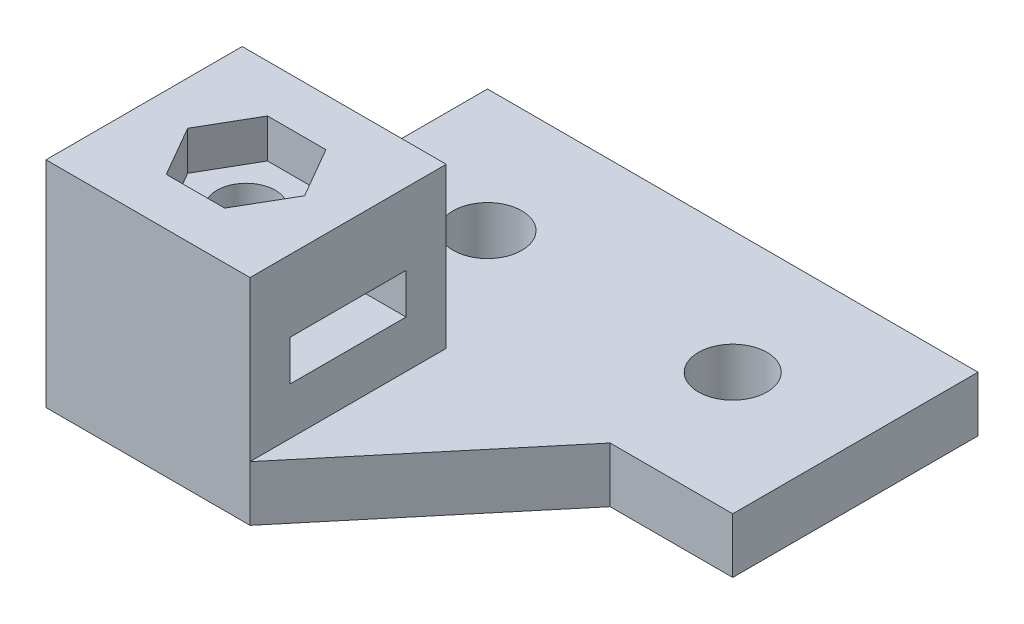
ISO-10303-21;
HEADER;
FILE_DESCRIPTION(('STEP AP214'),'2;1');
FILE_NAME('part.step','',(''),(''),'','','');
FILE_SCHEMA(('AUTOMOTIVE_DESIGN { 1 0 10303 214 1 1 1 1 }'));
ENDSEC;
DATA;
#1=APPLICATION_CONTEXT('core data for automotive mechanical design processes');
#2=APPLICATION_PROTOCOL_DEFINITION('international standard','automotive_design',2000,#1);
#3=PRODUCT_CONTEXT('',#1,'mechanical');
#4=PRODUCT('Part','Part','',(#3));
#5=PRODUCT_RELATED_PRODUCT_CATEGORY('part','',(#4));
#6=PRODUCT_DEFINITION_FORMATION('','',#4);
#7=PRODUCT_DEFINITION_CONTEXT('part definition',#1,'design');
#8=PRODUCT_DEFINITION('design','',#6,#7);
#9=PRODUCT_DEFINITION_SHAPE('','',#8);
#10=(LENGTH_UNIT() NAMED_UNIT(*) SI_UNIT(.MILLI.,.METRE.));
#11=(NAMED_UNIT(*) PLANE_ANGLE_UNIT() SI_UNIT($,.RADIAN.));
#12=(NAMED_UNIT(*) SI_UNIT($,.STERADIAN.) SOLID_ANGLE_UNIT());
#13=UNCERTAINTY_MEASURE_WITH_UNIT(LENGTH_MEASURE(1.E-05),#10,'distance_accuracy_value','');
#14=(GEOMETRIC_REPRESENTATION_CONTEXT(3) GLOBAL_UNCERTAINTY_ASSIGNED_CONTEXT((#13)) GLOBAL_UNIT_ASSIGNED_CONTEXT((#10,
#11,#12)) REPRESENTATION_CONTEXT('',''));
#15=CARTESIAN_POINT('',(0.,0.,0.));
#16=DIRECTION('',(0.,0.,1.));
#17=DIRECTION('',(1.,0.,0.));
#18=AXIS2_PLACEMENT_3D('',#15,#16,#17);
#19=CARTESIAN_POINT('',(-10.,4.5,0.));
#20=DIRECTION('',(-1.,0.,0.));
#21=DIRECTION('',(0.,0.,1.));
#22=AXIS2_PLACEMENT_3D('',#19,#20,#21);
#23=PLANE('',#22);
#24=DIRECTION('',(0.,0.,-1.));
#25=VECTOR('',#24,1.);
#26=CARTESIAN_POINT('',(-10.,0.,0.));
#27=LINE('',#26,#25);
#28=CARTESIAN_POINT('',(-10.,0.,26.));
#29=VERTEX_POINT('',#28);
#30=CARTESIAN_POINT('',(-10.,0.,-10.));
#31=VERTEX_POINT('',#30);
#32=EDGE_CURVE('E317',#29,#31,#27,.T.);
#33=ORIENTED_EDGE('',*,*,#32,.F.);
#34=DIRECTION('',(0.,-1.,0.));
#35=VECTOR('',#34,1.);
#36=CARTESIAN_POINT('',(-10.,17.5,26.));
#37=LINE('',#36,#35);
#38=CARTESIAN_POINT('',(-10.,17.5,26.));
#39=VERTEX_POINT('',#38);
#40=EDGE_CURVE('E267',#39,#29,#37,.T.);
#41=ORIENTED_EDGE('',*,*,#40,.F.);
#42=DIRECTION('',(0.,0.,-1.));
#43=VECTOR('',#42,1.);
#44=CARTESIAN_POINT('',(-10.,17.5,0.));
#45=LINE('',#44,#43);
#46=CARTESIAN_POINT('',(-10.,17.5,10.));
#47=VERTEX_POINT('',#46);
#48=EDGE_CURVE('E256',#39,#47,#45,.T.);
#49=ORIENTED_EDGE('',*,*,#48,.T.);
#50=DIRECTION('',(0.,-1.,0.));
#51=VECTOR('',#50,1.);
#52=CARTESIAN_POINT('',(-10.,17.5,10.));
#53=LINE('',#52,#51);
#54=CARTESIAN_POINT('',(-10.,4.5,10.));
#55=VERTEX_POINT('',#54);
#56=EDGE_CURVE('E270',#47,#55,#53,.T.);
#57=ORIENTED_EDGE('',*,*,#56,.T.);
#58=DIRECTION('',(0.,0.,-1.));
#59=VECTOR('',#58,1.);
#60=CARTESIAN_POINT('',(-10.,4.5,0.));
#61=LINE('',#60,#59);
#62=CARTESIAN_POINT('',(-10.,4.5,-10.));
#63=VERTEX_POINT('',#62);
#64=EDGE_CURVE('E294',#55,#63,#61,.T.);
#65=ORIENTED_EDGE('',*,*,#64,.T.);
#66=DIRECTION('',(0.,-1.,0.));
#67=VECTOR('',#66,1.);
#68=CARTESIAN_POINT('',(-10.,4.5,-10.));
#69=LINE('',#68,#67);
#70=EDGE_CURVE('E326',#63,#31,#69,.T.);
#71=ORIENTED_EDGE('',*,*,#70,.T.);
#72=EDGE_LOOP('',(#33,#41,#49,#57,#65,#71));
#73=FACE_BOUND('',#72,.T.);
#74=DIRECTION('',(0.,0.,-1.));
#75=VECTOR('',#74,1.);
#76=CARTESIAN_POINT('',(-10.,11.65,22.725));
#77=LINE('',#76,#75);
#78=CARTESIAN_POINT('',(-10.,11.65,22.725));
#79=VERTEX_POINT('',#78);
#80=CARTESIAN_POINT('',(-10.,11.65,13.275));
#81=VERTEX_POINT('',#80);
#82=EDGE_CURVE('E223',#79,#81,#77,.T.);
#83=ORIENTED_EDGE('',*,*,#82,.F.);
#84=DIRECTION('',(0.,1.,0.));
#85=VECTOR('',#84,1.);
#86=CARTESIAN_POINT('',(-10.,8.35,22.725));
#87=LINE('',#86,#85);
#88=CARTESIAN_POINT('',(-10.,8.35,22.725));
#89=VERTEX_POINT('',#88);
#90=EDGE_CURVE('E221',#89,#79,#87,.T.);
#91=ORIENTED_EDGE('',*,*,#90,.F.);
#92=DIRECTION('',(0.,0.,-1.));
#93=VECTOR('',#92,1.);
#94=CARTESIAN_POINT('',(-10.,8.35,22.725));
#95=LINE('',#94,#93);
#96=CARTESIAN_POINT('',(-10.,8.35,13.275));
#97=VERTEX_POINT('',#96);
#98=EDGE_CURVE('E227',#89,#97,#95,.T.);
#99=ORIENTED_EDGE('',*,*,#98,.T.);
#100=DIRECTION('',(0.,1.,0.));
#101=VECTOR('',#100,1.);
#102=CARTESIAN_POINT('',(-10.,8.35,13.275));
#103=LINE('',#102,#101);
#104=EDGE_CURVE('E58',#97,#81,#103,.T.);
#105=ORIENTED_EDGE('',*,*,#104,.T.);
#106=EDGE_LOOP('',(#83,#91,#99,#105));
#107=FACE_BOUND('',#106,.T.);
#108=ADVANCED_FACE('F35',(#73,#107),#23,.T.);
#109=CARTESIAN_POINT('',(6.63635443655153,17.5,0.));
#110=DIRECTION('',(1.,0.,0.));
#111=DIRECTION('',(0.,0.,-1.));
#112=AXIS2_PLACEMENT_3D('',#109,#110,#111);
#113=PLANE('',#112);
#114=DIRECTION('',(0.,-1.,0.));
#115=VECTOR('',#114,1.);
#116=CARTESIAN_POINT('',(6.63635443655153,17.5,26.));
#117=LINE('',#116,#115);
#118=CARTESIAN_POINT('',(6.63635443655153,17.5,26.));
#119=VERTEX_POINT('',#118);
#120=CARTESIAN_POINT('',(6.63635443655153,4.5,26.));
#121=VERTEX_POINT('',#120);
#122=EDGE_CURVE('E262',#119,#121,#117,.T.);
#123=ORIENTED_EDGE('',*,*,#122,.T.);
#124=DIRECTION('',(0.,0.,1.));
#125=VECTOR('',#124,1.);
#126=CARTESIAN_POINT('',(6.63635443655153,4.5,0.));
#127=LINE('',#126,#125);
#128=CARTESIAN_POINT('',(6.63635443655153,4.5,10.));
#129=VERTEX_POINT('',#128);
#130=EDGE_CURVE('E297',#129,#121,#127,.T.);
#131=ORIENTED_EDGE('',*,*,#130,.F.);
#132=DIRECTION('',(0.,-1.,0.));
#133=VECTOR('',#132,1.);
#134=CARTESIAN_POINT('',(6.63635443655153,17.5,10.));
#135=LINE('',#134,#133);
#136=CARTESIAN_POINT('',(6.63635443655153,17.5,10.));
#137=VERTEX_POINT('',#136);
#138=EDGE_CURVE('E273',#137,#129,#135,.T.);
#139=ORIENTED_EDGE('',*,*,#138,.F.);
#140=DIRECTION('',(0.,0.,1.));
#141=VECTOR('',#140,1.);
#142=CARTESIAN_POINT('',(6.63635443655153,17.5,0.));
#143=LINE('',#142,#141);
#144=EDGE_CURVE('E251',#137,#119,#143,.T.);
#145=ORIENTED_EDGE('',*,*,#144,.T.);
#146=EDGE_LOOP('',(#123,#131,#139,#145));
#147=FACE_BOUND('',#146,.T.);
#148=DIRECTION('',(0.,0.,-1.));
#149=VECTOR('',#148,1.);
#150=CARTESIAN_POINT('',(6.63635443655153,8.35,22.725));
#151=LINE('',#150,#149);
#152=CARTESIAN_POINT('',(6.63635443655153,8.35,22.725));
#153=VERTEX_POINT('',#152);
#154=CARTESIAN_POINT('',(6.63635443655153,8.35,13.275));
#155=VERTEX_POINT('',#154);
#156=EDGE_CURVE('E224',#153,#155,#151,.T.);
#157=ORIENTED_EDGE('',*,*,#156,.F.);
#158=DIRECTION('',(0.,1.,0.));
#159=VECTOR('',#158,1.);
#160=CARTESIAN_POINT('',(6.63635443655153,8.35,22.725));
#161=LINE('',#160,#159);
#162=CARTESIAN_POINT('',(6.63635443655153,11.65,22.725));
#163=VERTEX_POINT('',#162);
#164=EDGE_CURVE('E213',#153,#163,#161,.T.);
#165=ORIENTED_EDGE('',*,*,#164,.T.);
#166=DIRECTION('',(0.,0.,-1.));
#167=VECTOR('',#166,1.);
#168=CARTESIAN_POINT('',(6.63635443655153,11.65,22.725));
#169=LINE('',#168,#167);
#170=CARTESIAN_POINT('',(6.63635443655153,11.65,13.275));
#171=VERTEX_POINT('',#170);
#172=EDGE_CURVE('E233',#163,#171,#169,.T.);
#173=ORIENTED_EDGE('',*,*,#172,.T.);
#174=DIRECTION('',(0.,1.,0.));
#175=VECTOR('',#174,1.);
#176=CARTESIAN_POINT('',(6.63635443655153,8.35,13.275));
#177=LINE('',#176,#175);
#178=EDGE_CURVE('E236',#155,#171,#177,.T.);
#179=ORIENTED_EDGE('',*,*,#178,.F.);
#180=EDGE_LOOP('',(#157,#165,#173,#179));
#181=FACE_BOUND('',#180,.T.);
#182=ADVANCED_FACE('F364',(#147,#181),#113,.T.);
#183=CARTESIAN_POINT('',(0.,4.5,10.));
#184=DIRECTION('',(0.,0.,1.));
#185=DIRECTION('',(1.,0.,0.));
#186=AXIS2_PLACEMENT_3D('',#183,#184,#185);
#187=PLANE('',#186);
#188=DIRECTION('',(-1.,0.,0.));
#189=VECTOR('',#188,1.);
#190=CARTESIAN_POINT('',(0.,0.,10.));
#191=LINE('',#190,#189);
#192=CARTESIAN_POINT('',(30.,0.,10.));
#193=VERTEX_POINT('',#192);
#194=CARTESIAN_POINT('',(20.,0.,10.));
#195=VERTEX_POINT('',#194);
#196=EDGE_CURVE('E308',#193,#195,#191,.T.);
#197=ORIENTED_EDGE('',*,*,#196,.F.);
#198=DIRECTION('',(0.,-1.,0.));
#199=VECTOR('',#198,1.);
#200=CARTESIAN_POINT('',(30.,4.5,10.));
#201=LINE('',#200,#199);
#202=CARTESIAN_POINT('',(30.,4.5,10.));
#203=VERTEX_POINT('',#202);
#204=EDGE_CURVE('E11',#203,#193,#201,.T.);
#205=ORIENTED_EDGE('',*,*,#204,.F.);
#206=DIRECTION('',(-1.,0.,0.));
#207=VECTOR('',#206,1.);
#208=CARTESIAN_POINT('',(0.,4.5,10.));
#209=LINE('',#208,#207);
#210=CARTESIAN_POINT('',(20.,4.5,10.));
#211=VERTEX_POINT('',#210);
#212=EDGE_CURVE('E284',#203,#211,#209,.T.);
#213=ORIENTED_EDGE('',*,*,#212,.T.);
#214=DIRECTION('',(0.,-1.,0.));
#215=VECTOR('',#214,1.);
#216=CARTESIAN_POINT('',(20.,4.5,10.));
#217=LINE('',#216,#215);
#218=EDGE_CURVE('E302',#211,#195,#217,.T.);
#219=ORIENTED_EDGE('',*,*,#218,.T.);
#220=EDGE_LOOP('',(#197,#205,#213,#219));
#221=FACE_BOUND('',#220,.T.);
#222=ADVANCED_FACE('F360',(#221),#187,.T.);
#223=CARTESIAN_POINT('',(30.,4.5,0.));
#224=DIRECTION('',(1.,0.,0.));
#225=DIRECTION('',(0.,0.,-1.));
#226=AXIS2_PLACEMENT_3D('',#223,#224,#225);
#227=PLANE('',#226);
#228=DIRECTION('',(0.,0.,1.));
#229=VECTOR('',#228,1.);
#230=CARTESIAN_POINT('',(30.,0.,0.));
#231=LINE('',#230,#229);
#232=CARTESIAN_POINT('',(30.,0.,-10.));
#233=VERTEX_POINT('',#232);
#234=EDGE_CURVE('E311',#233,#193,#231,.T.);
#235=ORIENTED_EDGE('',*,*,#234,.F.);
#236=DIRECTION('',(0.,-1.,0.));
#237=VECTOR('',#236,1.);
#238=CARTESIAN_POINT('',(30.,4.5,-10.));
#239=LINE('',#238,#237);
#240=CARTESIAN_POINT('',(30.,4.5,-10.));
#241=VERTEX_POINT('',#240);
#242=EDGE_CURVE('E43',#241,#233,#239,.T.);
#243=ORIENTED_EDGE('',*,*,#242,.F.);
#244=DIRECTION('',(0.,0.,1.));
#245=VECTOR('',#244,1.);
#246=CARTESIAN_POINT('',(30.,4.5,0.));
#247=LINE('',#246,#245);
#248=EDGE_CURVE('E287',#241,#203,#247,.T.);
#249=ORIENTED_EDGE('',*,*,#248,.T.);
#250=ORIENTED_EDGE('',*,*,#204,.T.);
#251=EDGE_LOOP('',(#235,#243,#249,#250));
#252=FACE_BOUND('',#251,.T.);
#253=ADVANCED_FACE('F334',(#252),#227,.T.);
#254=CARTESIAN_POINT('',(0.,4.5,-10.));
#255=DIRECTION('',(0.,0.,-1.));
#256=DIRECTION('',(-1.,0.,0.));
#257=AXIS2_PLACEMENT_3D('',#254,#255,#256);
#258=PLANE('',#257);
#259=DIRECTION('',(1.,0.,0.));
#260=VECTOR('',#259,1.);
#261=CARTESIAN_POINT('',(0.,0.,-10.));
#262=LINE('',#261,#260);
#263=EDGE_CURVE('E314',#31,#233,#262,.T.);
#264=ORIENTED_EDGE('',*,*,#263,.F.);
#265=ORIENTED_EDGE('',*,*,#70,.F.);
#266=DIRECTION('',(1.,0.,0.));
#267=VECTOR('',#266,1.);
#268=CARTESIAN_POINT('',(0.,4.5,-10.));
#269=LINE('',#268,#267);
#270=EDGE_CURVE('E291',#63,#241,#269,.T.);
#271=ORIENTED_EDGE('',*,*,#270,.T.);
#272=ORIENTED_EDGE('',*,*,#242,.T.);
#273=EDGE_LOOP('',(#264,#265,#271,#272));
#274=FACE_BOUND('',#273,.T.);
#275=ADVANCED_FACE('F330',(#274),#258,.T.);
#276=CARTESIAN_POINT('',(0.,4.5,0.));
#277=DIRECTION('',(0.,-1.,0.));
#278=DIRECTION('',(0.,0.,-1.));
#279=AXIS2_PLACEMENT_3D('',#276,#277,#278);
#280=CYLINDRICAL_SURFACE('',#279,2.8);
#281=CARTESIAN_POINT('',(0.,4.5,0.));
#282=DIRECTION('',(0.,1.,0.));
#283=DIRECTION('',(0.,0.,1.));
#284=AXIS2_PLACEMENT_3D('',#281,#282,#283);
#285=CIRCLE('',#284,2.8);
#286=CARTESIAN_POINT('',(0.,4.5,2.8));
#287=VERTEX_POINT('',#286);
#288=EDGE_CURVE('E280',#287,#287,#285,.T.);
#289=ORIENTED_EDGE('',*,*,#288,.T.);
#290=EDGE_LOOP('',(#289));
#291=FACE_BOUND('',#290,.T.);
#292=CARTESIAN_POINT('',(0.,0.,0.));
#293=DIRECTION('',(0.,1.,0.));
#294=DIRECTION('',(0.,0.,1.));
#295=AXIS2_PLACEMENT_3D('',#292,#293,#294);
#296=CIRCLE('',#295,2.8);
#297=CARTESIAN_POINT('',(0.,0.,2.8));
#298=VERTEX_POINT('',#297);
#299=EDGE_CURVE('E305',#298,#298,#296,.T.);
#300=ORIENTED_EDGE('',*,*,#299,.F.);
#301=EDGE_LOOP('',(#300));
#302=FACE_BOUND('',#301,.T.);
#303=ADVANCED_FACE('F386',(#291,#302),#280,.F.);
#304=CARTESIAN_POINT('',(20.,4.5,0.));
#305=DIRECTION('',(0.,-1.,0.));
#306=DIRECTION('',(0.,0.,-1.));
#307=AXIS2_PLACEMENT_3D('',#304,#305,#306);
#308=CYLINDRICAL_SURFACE('',#307,2.8);
#309=CARTESIAN_POINT('',(20.,4.5,0.));
#310=DIRECTION('',(0.,1.,0.));
#311=DIRECTION('',(0.,0.,1.));
#312=AXIS2_PLACEMENT_3D('',#309,#310,#311);
#313=CIRCLE('',#312,2.8);
#314=CARTESIAN_POINT('',(20.,4.5,2.8));
#315=VERTEX_POINT('',#314);
#316=EDGE_CURVE('E277',#315,#315,#313,.T.);
#317=ORIENTED_EDGE('',*,*,#316,.T.);
#318=EDGE_LOOP('',(#317));
#319=FACE_BOUND('',#318,.T.);
#320=CARTESIAN_POINT('',(20.,0.,0.));
#321=DIRECTION('',(0.,1.,0.));
#322=DIRECTION('',(0.,0.,1.));
#323=AXIS2_PLACEMENT_3D('',#320,#321,#322);
#324=CIRCLE('',#323,2.8);
#325=CARTESIAN_POINT('',(20.,0.,2.8));
#326=VERTEX_POINT('',#325);
#327=EDGE_CURVE('E276',#326,#326,#324,.T.);
#328=ORIENTED_EDGE('',*,*,#327,.F.);
#329=EDGE_LOOP('',(#328));
#330=FACE_BOUND('',#329,.T.);
#331=ADVANCED_FACE('F37',(#319,#330),#308,.F.);
#332=CARTESIAN_POINT('',(16.7013346240728,4.5,13.9494197720412));
#333=DIRECTION('',(-0.767505693478615,0.,-0.641042128473559));
#334=DIRECTION('',(-0.641042128473559,0.,0.767505693478615));
#335=AXIS2_PLACEMENT_3D('',#332,#333,#334);
#336=PLANE('',#335);
#337=DIRECTION('',(0.641042128473559,0.,-0.767505693478615));
#338=VECTOR('',#337,1.);
#339=CARTESIAN_POINT('',(16.7013346240728,0.,13.9494197720412));
#340=LINE('',#339,#338);
#341=CARTESIAN_POINT('',(6.63635443655153,0.,26.));
#342=VERTEX_POINT('',#341);
#343=EDGE_CURVE('E281',#342,#195,#340,.T.);
#344=ORIENTED_EDGE('',*,*,#343,.T.);
#345=ORIENTED_EDGE('',*,*,#218,.F.);
#346=DIRECTION('',(0.641042128473559,0.,-0.767505693478615));
#347=VECTOR('',#346,1.);
#348=CARTESIAN_POINT('',(16.7013346240728,4.5,13.9494197720412));
#349=LINE('',#348,#347);
#350=EDGE_CURVE('E300',#121,#211,#349,.T.);
#351=ORIENTED_EDGE('',*,*,#350,.F.);
#352=DIRECTION('',(0.,-1.,0.));
#353=VECTOR('',#352,1.);
#354=CARTESIAN_POINT('',(6.63635443655153,4.5,26.));
#355=LINE('',#354,#353);
#356=EDGE_CURVE('E323',#121,#342,#355,.T.);
#357=ORIENTED_EDGE('',*,*,#356,.T.);
#358=EDGE_LOOP('',(#344,#345,#351,#357));
#359=FACE_BOUND('',#358,.T.);
#360=ADVANCED_FACE('F362',(#359),#336,.F.);
#361=CARTESIAN_POINT('',(0.,4.5,0.));
#362=DIRECTION('',(0.,1.,0.));
#363=DIRECTION('',(0.,0.,1.));
#364=AXIS2_PLACEMENT_3D('',#361,#362,#363);
#365=PLANE('',#364);
#366=ORIENTED_EDGE('',*,*,#316,.F.);
#367=EDGE_LOOP('',(#366));
#368=FACE_BOUND('',#367,.T.);
#369=ORIENTED_EDGE('',*,*,#288,.F.);
#370=EDGE_LOOP('',(#369));
#371=FACE_BOUND('',#370,.T.);
#372=ORIENTED_EDGE('',*,*,#212,.F.);
#373=ORIENTED_EDGE('',*,*,#248,.F.);
#374=ORIENTED_EDGE('',*,*,#270,.F.);
#375=ORIENTED_EDGE('',*,*,#64,.F.);
#376=EDGE_CURVE('E288',#129,#55,#209,.T.);
#377=ORIENTED_EDGE('',*,*,#376,.F.);
#378=ORIENTED_EDGE('',*,*,#130,.T.);
#379=ORIENTED_EDGE('',*,*,#350,.T.);
#380=EDGE_LOOP('',(#372,#373,#374,#375,#377,#378,#379));
#381=FACE_BOUND('',#380,.T.);
#382=ADVANCED_FACE('F356',(#368,#371,#381),#365,.T.);
#383=CARTESIAN_POINT('',(0.,0.,0.));
#384=DIRECTION('',(0.,1.,0.));
#385=DIRECTION('',(0.,0.,1.));
#386=AXIS2_PLACEMENT_3D('',#383,#384,#385);
#387=PLANE('',#386);
#388=ORIENTED_EDGE('',*,*,#343,.F.);
#389=DIRECTION('',(-1.,0.,0.));
#390=VECTOR('',#389,1.);
#391=CARTESIAN_POINT('',(0.,0.,26.));
#392=LINE('',#391,#390);
#393=EDGE_CURVE('E250',#342,#29,#392,.T.);
#394=ORIENTED_EDGE('',*,*,#393,.T.);
#395=ORIENTED_EDGE('',*,*,#32,.T.);
#396=ORIENTED_EDGE('',*,*,#263,.T.);
#397=ORIENTED_EDGE('',*,*,#234,.T.);
#398=ORIENTED_EDGE('',*,*,#196,.T.);
#399=EDGE_LOOP('',(#388,#394,#395,#396,#397,#398));
#400=FACE_BOUND('',#399,.T.);
#401=ORIENTED_EDGE('',*,*,#327,.T.);
#402=EDGE_LOOP('',(#401));
#403=FACE_BOUND('',#402,.T.);
#404=ORIENTED_EDGE('',*,*,#299,.T.);
#405=EDGE_LOOP('',(#404));
#406=FACE_BOUND('',#405,.T.);
#407=ADVANCED_FACE('F338',(#400,#403,#406),#387,.F.);
#408=CARTESIAN_POINT('',(0.,17.5,10.));
#409=DIRECTION('',(0.,0.,1.));
#410=DIRECTION('',(1.,0.,0.));
#411=AXIS2_PLACEMENT_3D('',#408,#409,#410);
#412=PLANE('',#411);
#413=ORIENTED_EDGE('',*,*,#376,.T.);
#414=ORIENTED_EDGE('',*,*,#56,.F.);
#415=DIRECTION('',(-1.,0.,0.));
#416=VECTOR('',#415,1.);
#417=CARTESIAN_POINT('',(0.,17.5,10.));
#418=LINE('',#417,#416);
#419=EDGE_CURVE('E254',#137,#47,#418,.T.);
#420=ORIENTED_EDGE('',*,*,#419,.F.);
#421=ORIENTED_EDGE('',*,*,#138,.T.);
#422=EDGE_LOOP('',(#413,#414,#420,#421));
#423=FACE_BOUND('',#422,.T.);
#424=ADVANCED_FACE('F366',(#423),#412,.F.);
#425=CARTESIAN_POINT('',(0.,17.5,26.));
#426=DIRECTION('',(0.,0.,1.));
#427=DIRECTION('',(1.,0.,0.));
#428=AXIS2_PLACEMENT_3D('',#425,#426,#427);
#429=PLANE('',#428);
#430=ORIENTED_EDGE('',*,*,#393,.F.);
#431=ORIENTED_EDGE('',*,*,#356,.F.);
#432=ORIENTED_EDGE('',*,*,#122,.F.);
#433=DIRECTION('',(-1.,0.,0.));
#434=VECTOR('',#433,1.);
#435=CARTESIAN_POINT('',(0.,17.5,26.));
#436=LINE('',#435,#434);
#437=EDGE_CURVE('E259',#119,#39,#436,.T.);
#438=ORIENTED_EDGE('',*,*,#437,.T.);
#439=ORIENTED_EDGE('',*,*,#40,.T.);
#440=EDGE_LOOP('',(#430,#431,#432,#438,#439));
#441=FACE_BOUND('',#440,.T.);
#442=ADVANCED_FACE('F344',(#441),#429,.T.);
#443=CARTESIAN_POINT('',(0.,17.5,0.));
#444=DIRECTION('',(0.,1.,0.));
#445=DIRECTION('',(0.,0.,1.));
#446=AXIS2_PLACEMENT_3D('',#443,#444,#445);
#447=PLANE('',#446);
#448=DIRECTION('',(0.5,0.,0.866025403784439));
#449=VECTOR('',#448,1.);
#450=CARTESIAN_POINT('',(-6.44784925388459,17.5,18.));
#451=LINE('',#450,#449);
#452=CARTESIAN_POINT('',(-6.44784925388459,17.5,18.));
#453=VERTEX_POINT('',#452);
#454=CARTESIAN_POINT('',(-4.06483601780441,17.5,22.1275));
#455=VERTEX_POINT('',#454);
#456=EDGE_CURVE('E50',#453,#455,#451,.T.);
#457=ORIENTED_EDGE('',*,*,#456,.F.);
#458=DIRECTION('',(-0.5,0.,0.866025403784439));
#459=VECTOR('',#458,1.);
#460=CARTESIAN_POINT('',(-4.06483601780442,17.5,13.8725));
#461=LINE('',#460,#459);
#462=CARTESIAN_POINT('',(-4.06483601780442,17.5,13.8725));
#463=VERTEX_POINT('',#462);
#464=EDGE_CURVE('E184',#463,#453,#461,.T.);
#465=ORIENTED_EDGE('',*,*,#464,.F.);
#466=DIRECTION('',(-1.,0.,0.));
#467=VECTOR('',#466,1.);
#468=CARTESIAN_POINT('',(0.701190454355942,17.5,13.8725));
#469=LINE('',#468,#467);
#470=CARTESIAN_POINT('',(0.701190454355942,17.5,13.8725));
#471=VERTEX_POINT('',#470);
#472=EDGE_CURVE('E187',#471,#463,#469,.T.);
#473=ORIENTED_EDGE('',*,*,#472,.F.);
#474=DIRECTION('',(-0.5,0.,-0.866025403784438));
#475=VECTOR('',#474,1.);
#476=CARTESIAN_POINT('',(3.08420369043612,17.5,18.));
#477=LINE('',#476,#475);
#478=CARTESIAN_POINT('',(3.08420369043612,17.5,18.));
#479=VERTEX_POINT('',#478);
#480=EDGE_CURVE('E206',#479,#471,#477,.T.);
#481=ORIENTED_EDGE('',*,*,#480,.F.);
#482=DIRECTION('',(0.5,0.,-0.866025403784439));
#483=VECTOR('',#482,1.);
#484=CARTESIAN_POINT('',(0.701190454355943,17.5,22.1275));
#485=LINE('',#484,#483);
#486=CARTESIAN_POINT('',(0.701190454355943,17.5,22.1275));
#487=VERTEX_POINT('',#486);
#488=EDGE_CURVE('E203',#487,#479,#485,.T.);
#489=ORIENTED_EDGE('',*,*,#488,.F.);
#490=DIRECTION('',(1.,0.,0.));
#491=VECTOR('',#490,1.);
#492=CARTESIAN_POINT('',(-4.06483601780441,17.5,22.1275));
#493=LINE('',#492,#491);
#494=EDGE_CURVE('E201',#455,#487,#493,.T.);
#495=ORIENTED_EDGE('',*,*,#494,.F.);
#496=EDGE_LOOP('',(#457,#465,#473,#481,#489,#495));
#497=FACE_BOUND('',#496,.T.);
#498=ORIENTED_EDGE('',*,*,#144,.F.);
#499=ORIENTED_EDGE('',*,*,#419,.T.);
#500=ORIENTED_EDGE('',*,*,#48,.F.);
#501=ORIENTED_EDGE('',*,*,#437,.F.);
#502=EDGE_LOOP('',(#498,#499,#500,#501));
#503=FACE_BOUND('',#502,.T.);
#504=ADVANCED_FACE('F348',(#497,#503),#447,.T.);
#505=CARTESIAN_POINT('',(-10.,8.35,22.725));
#506=DIRECTION('',(0.,0.,-1.));
#507=DIRECTION('',(-1.,0.,0.));
#508=AXIS2_PLACEMENT_3D('',#505,#506,#507);
#509=PLANE('',#508);
#510=ORIENTED_EDGE('',*,*,#164,.F.);
#511=DIRECTION('',(1.,0.,0.));
#512=VECTOR('',#511,1.);
#513=CARTESIAN_POINT('',(-10.,8.35,22.725));
#514=LINE('',#513,#512);
#515=EDGE_CURVE('E230',#89,#153,#514,.T.);
#516=ORIENTED_EDGE('',*,*,#515,.F.);
#517=ORIENTED_EDGE('',*,*,#90,.T.);
#518=DIRECTION('',(1.,0.,0.));
#519=VECTOR('',#518,1.);
#520=CARTESIAN_POINT('',(-10.,11.65,22.725));
#521=LINE('',#520,#519);
#522=EDGE_CURVE('E247',#79,#163,#521,.T.);
#523=ORIENTED_EDGE('',*,*,#522,.T.);
#524=EDGE_LOOP('',(#510,#516,#517,#523));
#525=FACE_BOUND('',#524,.T.);
#526=ADVANCED_FACE('F454',(#525),#509,.T.);
#527=CARTESIAN_POINT('',(-10.,11.65,22.725));
#528=DIRECTION('',(0.,-1.,0.));
#529=DIRECTION('',(0.,0.,-1.));
#530=AXIS2_PLACEMENT_3D('',#527,#528,#529);
#531=PLANE('',#530);
#532=CARTESIAN_POINT('',(-1.68182278172424,11.65,18.));
#533=DIRECTION('',(0.,-1.,0.));
#534=DIRECTION('',(0.,0.,-1.));
#535=AXIS2_PLACEMENT_3D('',#532,#533,#534);
#536=CIRCLE('',#535,2.38125);
#537=CARTESIAN_POINT('',(-1.68182278172424,11.65,15.61875));
#538=VERTEX_POINT('',#537);
#539=EDGE_CURVE('E580',#538,#538,#536,.F.);
#540=ORIENTED_EDGE('',*,*,#539,.T.);
#541=EDGE_LOOP('',(#540));
#542=FACE_BOUND('',#541,.T.);
#543=ORIENTED_EDGE('',*,*,#172,.F.);
#544=ORIENTED_EDGE('',*,*,#522,.F.);
#545=ORIENTED_EDGE('',*,*,#82,.T.);
#546=DIRECTION('',(1.,0.,0.));
#547=VECTOR('',#546,1.);
#548=CARTESIAN_POINT('',(-10.,11.65,13.275));
#549=LINE('',#548,#547);
#550=EDGE_CURVE('E245',#81,#171,#549,.T.);
#551=ORIENTED_EDGE('',*,*,#550,.T.);
#552=EDGE_LOOP('',(#543,#544,#545,#551));
#553=FACE_BOUND('',#552,.T.);
#554=ADVANCED_FACE('F459',(#542,#553),#531,.T.);
#555=CARTESIAN_POINT('',(-10.,8.35,13.275));
#556=DIRECTION('',(0.,0.,-1.));
#557=DIRECTION('',(-1.,0.,0.));
#558=AXIS2_PLACEMENT_3D('',#555,#556,#557);
#559=PLANE('',#558);
#560=ORIENTED_EDGE('',*,*,#178,.T.);
#561=ORIENTED_EDGE('',*,*,#550,.F.);
#562=ORIENTED_EDGE('',*,*,#104,.F.);
#563=DIRECTION('',(1.,0.,0.));
#564=VECTOR('',#563,1.);
#565=CARTESIAN_POINT('',(-10.,8.35,13.275));
#566=LINE('',#565,#564);
#567=EDGE_CURVE('E243',#97,#155,#566,.T.);
#568=ORIENTED_EDGE('',*,*,#567,.T.);
#569=EDGE_LOOP('',(#560,#561,#562,#568));
#570=FACE_BOUND('',#569,.T.);
#571=ADVANCED_FACE('F468',(#570),#559,.F.);
#572=CARTESIAN_POINT('',(-10.,8.35,22.725));
#573=DIRECTION('',(0.,-1.,0.));
#574=DIRECTION('',(0.,0.,-1.));
#575=AXIS2_PLACEMENT_3D('',#572,#573,#574);
#576=PLANE('',#575);
#577=ORIENTED_EDGE('',*,*,#156,.T.);
#578=ORIENTED_EDGE('',*,*,#567,.F.);
#579=ORIENTED_EDGE('',*,*,#98,.F.);
#580=ORIENTED_EDGE('',*,*,#515,.T.);
#581=EDGE_LOOP('',(#577,#578,#579,#580));
#582=FACE_BOUND('',#581,.T.);
#583=ADVANCED_FACE('F473',(#582),#576,.F.);
#584=CARTESIAN_POINT('',(-6.44784925388459,14.32,18.));
#585=DIRECTION('',(-0.866025403784439,0.,0.5));
#586=DIRECTION('',(0.5,0.,0.866025403784439));
#587=AXIS2_PLACEMENT_3D('',#584,#585,#586);
#588=PLANE('',#587);
#589=ORIENTED_EDGE('',*,*,#456,.T.);
#590=DIRECTION('',(0.,1.,0.));
#591=VECTOR('',#590,1.);
#592=CARTESIAN_POINT('',(-4.06483601780441,14.32,22.1275));
#593=LINE('',#592,#591);
#594=CARTESIAN_POINT('',(-4.06483601780441,14.32,22.1275));
#595=VERTEX_POINT('',#594);
#596=EDGE_CURVE('E161',#595,#455,#593,.T.);
#597=ORIENTED_EDGE('',*,*,#596,.F.);
#598=DIRECTION('',(0.5,0.,0.866025403784439));
#599=VECTOR('',#598,1.);
#600=CARTESIAN_POINT('',(-6.44784925388459,14.32,18.));
#601=LINE('',#600,#599);
#602=CARTESIAN_POINT('',(-6.44784925388459,14.32,18.));
#603=VERTEX_POINT('',#602);
#604=EDGE_CURVE('E165',#603,#595,#601,.T.);
#605=ORIENTED_EDGE('',*,*,#604,.F.);
#606=DIRECTION('',(0.,1.,0.));
#607=VECTOR('',#606,1.);
#608=CARTESIAN_POINT('',(-6.44784925388459,14.32,18.));
#609=LINE('',#608,#607);
#610=EDGE_CURVE('E211',#603,#453,#609,.T.);
#611=ORIENTED_EDGE('',*,*,#610,.T.);
#612=EDGE_LOOP('',(#589,#597,#605,#611));
#613=FACE_BOUND('',#612,.T.);
#614=ADVANCED_FACE('F163',(#613),#588,.F.);
#615=CARTESIAN_POINT('',(-4.06483601780442,14.32,13.8725));
#616=DIRECTION('',(-0.866025403784439,0.,-0.5));
#617=DIRECTION('',(-0.5,0.,0.866025403784439));
#618=AXIS2_PLACEMENT_3D('',#615,#616,#617);
#619=PLANE('',#618);
#620=ORIENTED_EDGE('',*,*,#464,.T.);
#621=ORIENTED_EDGE('',*,*,#610,.F.);
#622=DIRECTION('',(-0.5,0.,0.866025403784439));
#623=VECTOR('',#622,1.);
#624=CARTESIAN_POINT('',(-4.06483601780442,14.32,13.8725));
#625=LINE('',#624,#623);
#626=CARTESIAN_POINT('',(-4.06483601780442,14.32,13.8725));
#627=VERTEX_POINT('',#626);
#628=EDGE_CURVE('E171',#627,#603,#625,.T.);
#629=ORIENTED_EDGE('',*,*,#628,.F.);
#630=DIRECTION('',(0.,1.,0.));
#631=VECTOR('',#630,1.);
#632=CARTESIAN_POINT('',(-4.06483601780442,14.32,13.8725));
#633=LINE('',#632,#631);
#634=EDGE_CURVE('E214',#627,#463,#633,.T.);
#635=ORIENTED_EDGE('',*,*,#634,.T.);
#636=EDGE_LOOP('',(#620,#621,#629,#635));
#637=FACE_BOUND('',#636,.T.);
#638=ADVANCED_FACE('F500',(#637),#619,.F.);
#639=CARTESIAN_POINT('',(0.701190454355942,14.32,13.8725));
#640=DIRECTION('',(0.,0.,-1.));
#641=DIRECTION('',(-1.,0.,0.));
#642=AXIS2_PLACEMENT_3D('',#639,#640,#641);
#643=PLANE('',#642);
#644=ORIENTED_EDGE('',*,*,#472,.T.);
#645=ORIENTED_EDGE('',*,*,#634,.F.);
#646=DIRECTION('',(-1.,0.,0.));
#647=VECTOR('',#646,1.);
#648=CARTESIAN_POINT('',(0.701190454355942,14.32,13.8725));
#649=LINE('',#648,#647);
#650=CARTESIAN_POINT('',(0.701190454355942,14.32,13.8725));
#651=VERTEX_POINT('',#650);
#652=EDGE_CURVE('E197',#651,#627,#649,.T.);
#653=ORIENTED_EDGE('',*,*,#652,.F.);
#654=DIRECTION('',(0.,1.,0.));
#655=VECTOR('',#654,1.);
#656=CARTESIAN_POINT('',(0.701190454355942,14.32,13.8725));
#657=LINE('',#656,#655);
#658=EDGE_CURVE('E216',#651,#471,#657,.T.);
#659=ORIENTED_EDGE('',*,*,#658,.T.);
#660=EDGE_LOOP('',(#644,#645,#653,#659));
#661=FACE_BOUND('',#660,.T.);
#662=ADVANCED_FACE('F509',(#661),#643,.F.);
#663=CARTESIAN_POINT('',(3.08420369043612,14.32,18.));
#664=DIRECTION('',(0.866025403784438,0.,-0.5));
#665=DIRECTION('',(-0.5,0.,-0.866025403784439));
#666=AXIS2_PLACEMENT_3D('',#663,#664,#665);
#667=PLANE('',#666);
#668=ORIENTED_EDGE('',*,*,#480,.T.);
#669=ORIENTED_EDGE('',*,*,#658,.F.);
#670=DIRECTION('',(-0.5,0.,-0.866025403784438));
#671=VECTOR('',#670,1.);
#672=CARTESIAN_POINT('',(3.08420369043612,14.32,18.));
#673=LINE('',#672,#671);
#674=CARTESIAN_POINT('',(3.08420369043612,14.32,18.));
#675=VERTEX_POINT('',#674);
#676=EDGE_CURVE('E194',#675,#651,#673,.T.);
#677=ORIENTED_EDGE('',*,*,#676,.F.);
#678=DIRECTION('',(0.,1.,0.));
#679=VECTOR('',#678,1.);
#680=CARTESIAN_POINT('',(3.08420369043612,14.32,18.));
#681=LINE('',#680,#679);
#682=EDGE_CURVE('E218',#675,#479,#681,.T.);
#683=ORIENTED_EDGE('',*,*,#682,.T.);
#684=EDGE_LOOP('',(#668,#669,#677,#683));
#685=FACE_BOUND('',#684,.T.);
#686=ADVANCED_FACE('F519',(#685),#667,.F.);
#687=CARTESIAN_POINT('',(0.701190454355943,14.32,22.1275));
#688=DIRECTION('',(0.866025403784439,0.,0.5));
#689=DIRECTION('',(0.5,0.,-0.866025403784439));
#690=AXIS2_PLACEMENT_3D('',#687,#688,#689);
#691=PLANE('',#690);
#692=ORIENTED_EDGE('',*,*,#488,.T.);
#693=ORIENTED_EDGE('',*,*,#682,.F.);
#694=DIRECTION('',(0.5,0.,-0.866025403784439));
#695=VECTOR('',#694,1.);
#696=CARTESIAN_POINT('',(0.701190454355943,14.32,22.1275));
#697=LINE('',#696,#695);
#698=CARTESIAN_POINT('',(0.701190454355943,14.32,22.1275));
#699=VERTEX_POINT('',#698);
#700=EDGE_CURVE('E179',#699,#675,#697,.T.);
#701=ORIENTED_EDGE('',*,*,#700,.F.);
#702=DIRECTION('',(0.,1.,0.));
#703=VECTOR('',#702,1.);
#704=CARTESIAN_POINT('',(0.701190454355943,14.32,22.1275));
#705=LINE('',#704,#703);
#706=EDGE_CURVE('E170',#699,#487,#705,.T.);
#707=ORIENTED_EDGE('',*,*,#706,.T.);
#708=EDGE_LOOP('',(#692,#693,#701,#707));
#709=FACE_BOUND('',#708,.T.);
#710=ADVANCED_FACE('F529',(#709),#691,.F.);
#711=CARTESIAN_POINT('',(-4.06483601780441,14.32,22.1275));
#712=DIRECTION('',(0.,0.,1.));
#713=DIRECTION('',(1.,0.,0.));
#714=AXIS2_PLACEMENT_3D('',#711,#712,#713);
#715=PLANE('',#714);
#716=ORIENTED_EDGE('',*,*,#494,.T.);
#717=ORIENTED_EDGE('',*,*,#706,.F.);
#718=DIRECTION('',(1.,0.,0.));
#719=VECTOR('',#718,1.);
#720=CARTESIAN_POINT('',(-4.06483601780441,14.32,22.1275));
#721=LINE('',#720,#719);
#722=EDGE_CURVE('E174',#595,#699,#721,.T.);
#723=ORIENTED_EDGE('',*,*,#722,.F.);
#724=ORIENTED_EDGE('',*,*,#596,.T.);
#725=EDGE_LOOP('',(#716,#717,#723,#724));
#726=FACE_BOUND('',#725,.T.);
#727=ADVANCED_FACE('F175',(#726),#715,.F.);
#728=CARTESIAN_POINT('',(0.,14.32,0.));
#729=DIRECTION('',(0.,1.,0.));
#730=DIRECTION('',(0.,0.,1.));
#731=AXIS2_PLACEMENT_3D('',#728,#729,#730);
#732=PLANE('',#731);
#733=CARTESIAN_POINT('',(-1.68182278172424,14.32,18.));
#734=DIRECTION('',(0.,1.,0.));
#735=DIRECTION('',(0.,0.,1.));
#736=AXIS2_PLACEMENT_3D('',#733,#734,#735);
#737=CIRCLE('',#736,2.38125);
#738=CARTESIAN_POINT('',(-1.68182278172424,14.32,20.38125));
#739=VERTEX_POINT('',#738);
#740=EDGE_CURVE('E190',#739,#739,#737,.F.);
#741=ORIENTED_EDGE('',*,*,#740,.T.);
#742=EDGE_LOOP('',(#741));
#743=FACE_BOUND('',#742,.T.);
#744=ORIENTED_EDGE('',*,*,#604,.T.);
#745=ORIENTED_EDGE('',*,*,#722,.T.);
#746=ORIENTED_EDGE('',*,*,#700,.T.);
#747=ORIENTED_EDGE('',*,*,#676,.T.);
#748=ORIENTED_EDGE('',*,*,#652,.T.);
#749=ORIENTED_EDGE('',*,*,#628,.T.);
#750=EDGE_LOOP('',(#744,#745,#746,#747,#748,#749));
#751=FACE_BOUND('',#750,.T.);
#752=ADVANCED_FACE('F181',(#743,#751),#732,.T.);
#753=CARTESIAN_POINT('',(-1.68182278172424,-0.001000000000001,18.));
#754=DIRECTION('',(0.,1.,0.));
#755=DIRECTION('',(0.,0.,1.));
#756=AXIS2_PLACEMENT_3D('',#753,#754,#755);
#757=CYLINDRICAL_SURFACE('',#756,2.38125);
#758=ORIENTED_EDGE('',*,*,#539,.F.);
#759=EDGE_LOOP('',(#758));
#760=FACE_BOUND('',#759,.T.);
#761=ORIENTED_EDGE('',*,*,#740,.F.);
#762=EDGE_LOOP('',(#761));
#763=FACE_BOUND('',#762,.T.);
#764=ADVANCED_FACE('F563',(#760,#763),#757,.F.);
#765=CLOSED_SHELL('',(#108,#182,#222,#253,#275,#303,#331,#360,#382,#407,#424,#442,#504,#526,
#554,#571,#583,#614,#638,#662,#686,#710,#727,#752,#764));
#766=MANIFOLD_SOLID_BREP('B2',#765);
#767=ADVANCED_BREP_SHAPE_REPRESENTATION('',(#18,#766),#14);
#768=SHAPE_DEFINITION_REPRESENTATION(#9,#767);
ENDSEC;
END-ISO-10303-21;
